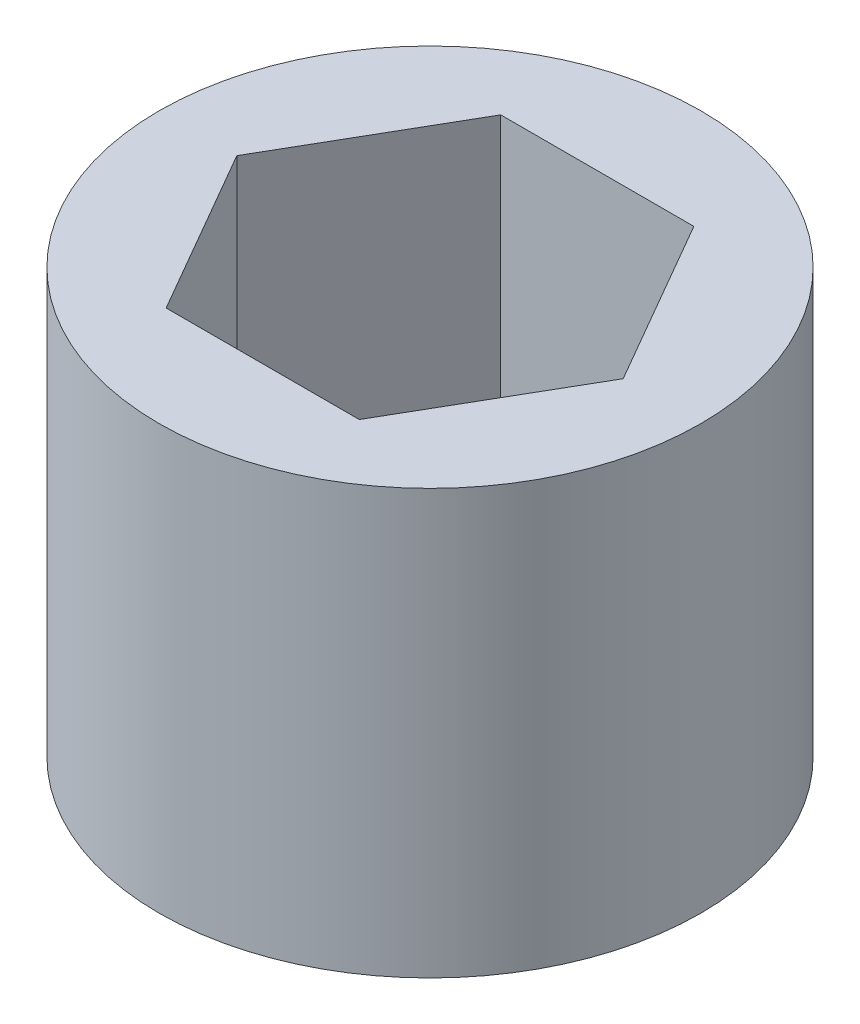
ISO-10303-21;
HEADER;
FILE_DESCRIPTION(('STEP AP214'),'2;1');
FILE_NAME('part.step','',(''),(''),'','','');
FILE_SCHEMA(('AUTOMOTIVE_DESIGN { 1 0 10303 214 1 1 1 1 }'));
ENDSEC;
DATA;
#1=APPLICATION_CONTEXT('core data for automotive mechanical design processes');
#2=APPLICATION_PROTOCOL_DEFINITION('international standard','automotive_design',2000,#1);
#3=PRODUCT_CONTEXT('',#1,'mechanical');
#4=PRODUCT('Part','Part','',(#3));
#5=PRODUCT_RELATED_PRODUCT_CATEGORY('part','',(#4));
#6=PRODUCT_DEFINITION_FORMATION('','',#4);
#7=PRODUCT_DEFINITION_CONTEXT('part definition',#1,'design');
#8=PRODUCT_DEFINITION('design','',#6,#7);
#9=PRODUCT_DEFINITION_SHAPE('','',#8);
#10=(LENGTH_UNIT() NAMED_UNIT(*) SI_UNIT(.MILLI.,.METRE.));
#11=(NAMED_UNIT(*) PLANE_ANGLE_UNIT() SI_UNIT($,.RADIAN.));
#12=(NAMED_UNIT(*) SI_UNIT($,.STERADIAN.) SOLID_ANGLE_UNIT());
#13=UNCERTAINTY_MEASURE_WITH_UNIT(LENGTH_MEASURE(1.E-05),#10,'distance_accuracy_value','');
#14=(GEOMETRIC_REPRESENTATION_CONTEXT(3) GLOBAL_UNCERTAINTY_ASSIGNED_CONTEXT((#13)) GLOBAL_UNIT_ASSIGNED_CONTEXT((#10,
#11,#12)) REPRESENTATION_CONTEXT('',''));
#15=CARTESIAN_POINT('',(0.,0.,0.));
#16=DIRECTION('',(0.,0.,1.));
#17=DIRECTION('',(1.,0.,0.));
#18=AXIS2_PLACEMENT_3D('',#15,#16,#17);
#19=CARTESIAN_POINT('',(-3.075,9.,1.7753520777581));
#20=DIRECTION('',(0.866025403784439,0.,-0.5));
#21=DIRECTION('',(-0.5,0.,-0.866025403784439));
#22=AXIS2_PLACEMENT_3D('',#19,#20,#21);
#23=PLANE('',#22);
#24=DIRECTION('',(0.5,0.,0.866025403784439));
#25=VECTOR('',#24,1.);
#26=CARTESIAN_POINT('',(-3.075,0.,1.7753520777581));
#27=LINE('',#26,#25);
#28=CARTESIAN_POINT('',(-4.1,0.,0.));
#29=VERTEX_POINT('',#28);
#30=CARTESIAN_POINT('',(-2.05,0.,3.5507041555162));
#31=VERTEX_POINT('',#30);
#32=EDGE_CURVE('E118',#29,#31,#27,.T.);
#33=ORIENTED_EDGE('',*,*,#32,.F.);
#34=DIRECTION('',(0.,-1.,0.));
#35=VECTOR('',#34,1.);
#36=CARTESIAN_POINT('',(-4.1,9.,0.));
#37=LINE('',#36,#35);
#38=CARTESIAN_POINT('',(-4.1,9.,0.));
#39=VERTEX_POINT('',#38);
#40=EDGE_CURVE('E11',#39,#29,#37,.T.);
#41=ORIENTED_EDGE('',*,*,#40,.F.);
#42=DIRECTION('',(0.5,0.,0.866025403784439));
#43=VECTOR('',#42,1.);
#44=CARTESIAN_POINT('',(-3.075,9.,1.7753520777581));
#45=LINE('',#44,#43);
#46=CARTESIAN_POINT('',(-2.05,9.,3.5507041555162));
#47=VERTEX_POINT('',#46);
#48=EDGE_CURVE('E135',#39,#47,#45,.T.);
#49=ORIENTED_EDGE('',*,*,#48,.T.);
#50=DIRECTION('',(0.,-1.,0.));
#51=VECTOR('',#50,1.);
#52=CARTESIAN_POINT('',(-2.05,9.,3.5507041555162));
#53=LINE('',#52,#51);
#54=EDGE_CURVE('E49',#47,#31,#53,.T.);
#55=ORIENTED_EDGE('',*,*,#54,.T.);
#56=EDGE_LOOP('',(#33,#41,#49,#55));
#57=FACE_BOUND('',#56,.T.);
#58=ADVANCED_FACE('F33',(#57),#23,.T.);
#59=CARTESIAN_POINT('',(-3.075,9.,-1.7753520777581));
#60=DIRECTION('',(0.866025403784439,0.,0.5));
#61=DIRECTION('',(0.5,0.,-0.866025403784439));
#62=AXIS2_PLACEMENT_3D('',#59,#60,#61);
#63=PLANE('',#62);
#64=DIRECTION('',(-0.5,0.,0.866025403784439));
#65=VECTOR('',#64,1.);
#66=CARTESIAN_POINT('',(-3.075,0.,-1.7753520777581));
#67=LINE('',#66,#65);
#68=CARTESIAN_POINT('',(-2.05,0.,-3.5507041555162));
#69=VERTEX_POINT('',#68);
#70=EDGE_CURVE('E120',#69,#29,#67,.T.);
#71=ORIENTED_EDGE('',*,*,#70,.F.);
#72=DIRECTION('',(0.,-1.,0.));
#73=VECTOR('',#72,1.);
#74=CARTESIAN_POINT('',(-2.05,9.,-3.5507041555162));
#75=LINE('',#74,#73);
#76=CARTESIAN_POINT('',(-2.05,9.,-3.5507041555162));
#77=VERTEX_POINT('',#76);
#78=EDGE_CURVE('E41',#77,#69,#75,.T.);
#79=ORIENTED_EDGE('',*,*,#78,.F.);
#80=DIRECTION('',(-0.5,0.,0.866025403784439));
#81=VECTOR('',#80,1.);
#82=CARTESIAN_POINT('',(-3.075,9.,-1.7753520777581));
#83=LINE('',#82,#81);
#84=EDGE_CURVE('E260',#77,#39,#83,.T.);
#85=ORIENTED_EDGE('',*,*,#84,.T.);
#86=ORIENTED_EDGE('',*,*,#40,.T.);
#87=EDGE_LOOP('',(#71,#79,#85,#86));
#88=FACE_BOUND('',#87,.T.);
#89=ADVANCED_FACE('F144',(#88),#63,.T.);
#90=CARTESIAN_POINT('',(0.,9.,-3.5507041555162));
#91=DIRECTION('',(0.,0.,1.));
#92=DIRECTION('',(1.,0.,0.));
#93=AXIS2_PLACEMENT_3D('',#90,#91,#92);
#94=PLANE('',#93);
#95=DIRECTION('',(-1.,0.,0.));
#96=VECTOR('',#95,1.);
#97=CARTESIAN_POINT('',(0.,0.,-3.5507041555162));
#98=LINE('',#97,#96);
#99=CARTESIAN_POINT('',(2.05,0.,-3.5507041555162));
#100=VERTEX_POINT('',#99);
#101=EDGE_CURVE('E123',#100,#69,#98,.T.);
#102=ORIENTED_EDGE('',*,*,#101,.F.);
#103=DIRECTION('',(0.,-1.,0.));
#104=VECTOR('',#103,1.);
#105=CARTESIAN_POINT('',(2.05,9.,-3.5507041555162));
#106=LINE('',#105,#104);
#107=CARTESIAN_POINT('',(2.05,9.,-3.5507041555162));
#108=VERTEX_POINT('',#107);
#109=EDGE_CURVE('E96',#108,#100,#106,.T.);
#110=ORIENTED_EDGE('',*,*,#109,.F.);
#111=DIRECTION('',(-1.,0.,0.));
#112=VECTOR('',#111,1.);
#113=CARTESIAN_POINT('',(0.,9.,-3.5507041555162));
#114=LINE('',#113,#112);
#115=EDGE_CURVE('E107',#108,#77,#114,.T.);
#116=ORIENTED_EDGE('',*,*,#115,.T.);
#117=ORIENTED_EDGE('',*,*,#78,.T.);
#118=EDGE_LOOP('',(#102,#110,#116,#117));
#119=FACE_BOUND('',#118,.T.);
#120=ADVANCED_FACE('F141',(#119),#94,.T.);
#121=CARTESIAN_POINT('',(3.075,9.,-1.7753520777581));
#122=DIRECTION('',(-0.866025403784439,0.,0.5));
#123=DIRECTION('',(0.5,0.,0.866025403784439));
#124=AXIS2_PLACEMENT_3D('',#121,#122,#123);
#125=PLANE('',#124);
#126=DIRECTION('',(-0.5,0.,-0.866025403784439));
#127=VECTOR('',#126,1.);
#128=CARTESIAN_POINT('',(3.075,0.,-1.7753520777581));
#129=LINE('',#128,#127);
#130=CARTESIAN_POINT('',(4.1,0.,0.));
#131=VERTEX_POINT('',#130);
#132=EDGE_CURVE('E92',#131,#100,#129,.T.);
#133=ORIENTED_EDGE('',*,*,#132,.F.);
#134=DIRECTION('',(0.,-1.,0.));
#135=VECTOR('',#134,1.);
#136=CARTESIAN_POINT('',(4.1,9.,0.));
#137=LINE('',#136,#135);
#138=CARTESIAN_POINT('',(4.1,9.,0.));
#139=VERTEX_POINT('',#138);
#140=EDGE_CURVE('E87',#139,#131,#137,.T.);
#141=ORIENTED_EDGE('',*,*,#140,.F.);
#142=DIRECTION('',(-0.5,0.,-0.866025403784439));
#143=VECTOR('',#142,1.);
#144=CARTESIAN_POINT('',(3.075,9.,-1.7753520777581));
#145=LINE('',#144,#143);
#146=EDGE_CURVE('E90',#139,#108,#145,.T.);
#147=ORIENTED_EDGE('',*,*,#146,.T.);
#148=ORIENTED_EDGE('',*,*,#109,.T.);
#149=EDGE_LOOP('',(#133,#141,#147,#148));
#150=FACE_BOUND('',#149,.T.);
#151=ADVANCED_FACE('F89',(#150),#125,.T.);
#152=CARTESIAN_POINT('',(3.075,9.,1.7753520777581));
#153=DIRECTION('',(-0.866025403784439,0.,-0.5));
#154=DIRECTION('',(-0.5,0.,0.866025403784439));
#155=AXIS2_PLACEMENT_3D('',#152,#153,#154);
#156=PLANE('',#155);
#157=DIRECTION('',(0.5,0.,-0.866025403784439));
#158=VECTOR('',#157,1.);
#159=CARTESIAN_POINT('',(3.075,0.,1.7753520777581));
#160=LINE('',#159,#158);
#161=CARTESIAN_POINT('',(2.05,0.,3.5507041555162));
#162=VERTEX_POINT('',#161);
#163=EDGE_CURVE('E127',#162,#131,#160,.T.);
#164=ORIENTED_EDGE('',*,*,#163,.F.);
#165=DIRECTION('',(0.,-1.,0.));
#166=VECTOR('',#165,1.);
#167=CARTESIAN_POINT('',(2.05,9.,3.5507041555162));
#168=LINE('',#167,#166);
#169=CARTESIAN_POINT('',(2.05,9.,3.5507041555162));
#170=VERTEX_POINT('',#169);
#171=EDGE_CURVE('E68',#170,#162,#168,.T.);
#172=ORIENTED_EDGE('',*,*,#171,.F.);
#173=DIRECTION('',(0.5,0.,-0.866025403784439));
#174=VECTOR('',#173,1.);
#175=CARTESIAN_POINT('',(3.075,9.,1.7753520777581));
#176=LINE('',#175,#174);
#177=EDGE_CURVE('E104',#170,#139,#176,.T.);
#178=ORIENTED_EDGE('',*,*,#177,.T.);
#179=ORIENTED_EDGE('',*,*,#140,.T.);
#180=EDGE_LOOP('',(#164,#172,#178,#179));
#181=FACE_BOUND('',#180,.T.);
#182=ADVANCED_FACE('F109',(#181),#156,.T.);
#183=CARTESIAN_POINT('',(0.,9.,3.5507041555162));
#184=DIRECTION('',(0.,0.,-1.));
#185=DIRECTION('',(-1.,0.,0.));
#186=AXIS2_PLACEMENT_3D('',#183,#184,#185);
#187=PLANE('',#186);
#188=DIRECTION('',(1.,0.,0.));
#189=VECTOR('',#188,1.);
#190=CARTESIAN_POINT('',(0.,0.,3.5507041555162));
#191=LINE('',#190,#189);
#192=EDGE_CURVE('E129',#31,#162,#191,.T.);
#193=ORIENTED_EDGE('',*,*,#192,.F.);
#194=ORIENTED_EDGE('',*,*,#54,.F.);
#195=DIRECTION('',(1.,0.,0.));
#196=VECTOR('',#195,1.);
#197=CARTESIAN_POINT('',(0.,9.,3.5507041555162));
#198=LINE('',#197,#196);
#199=EDGE_CURVE('E110',#47,#170,#198,.T.);
#200=ORIENTED_EDGE('',*,*,#199,.T.);
#201=ORIENTED_EDGE('',*,*,#171,.T.);
#202=EDGE_LOOP('',(#193,#194,#200,#201));
#203=FACE_BOUND('',#202,.T.);
#204=ADVANCED_FACE('F148',(#203),#187,.T.);
#205=CARTESIAN_POINT('',(0.,9.,0.));
#206=DIRECTION('',(0.,-1.,0.));
#207=DIRECTION('',(0.,0.,-1.));
#208=AXIS2_PLACEMENT_3D('',#205,#206,#207);
#209=CYLINDRICAL_SURFACE('',#208,5.75);
#210=CARTESIAN_POINT('',(0.,9.,0.));
#211=DIRECTION('',(0.,1.,0.));
#212=DIRECTION('',(0.,0.,1.));
#213=AXIS2_PLACEMENT_3D('',#210,#211,#212);
#214=CIRCLE('',#213,5.75);
#215=CARTESIAN_POINT('',(0.,9.,5.75));
#216=VERTEX_POINT('',#215);
#217=EDGE_CURVE('E112',#216,#216,#214,.T.);
#218=ORIENTED_EDGE('',*,*,#217,.F.);
#219=EDGE_LOOP('',(#218));
#220=FACE_BOUND('',#219,.T.);
#221=CARTESIAN_POINT('',(0.,0.,0.));
#222=DIRECTION('',(0.,1.,0.));
#223=DIRECTION('',(0.,0.,1.));
#224=AXIS2_PLACEMENT_3D('',#221,#222,#223);
#225=CIRCLE('',#224,5.75);
#226=CARTESIAN_POINT('',(0.,0.,5.75));
#227=VERTEX_POINT('',#226);
#228=EDGE_CURVE('E132',#227,#227,#225,.T.);
#229=ORIENTED_EDGE('',*,*,#228,.T.);
#230=EDGE_LOOP('',(#229));
#231=FACE_BOUND('',#230,.T.);
#232=ADVANCED_FACE('F150',(#220,#231),#209,.T.);
#233=CARTESIAN_POINT('',(0.,9.,0.));
#234=DIRECTION('',(0.,1.,0.));
#235=DIRECTION('',(0.,0.,1.));
#236=AXIS2_PLACEMENT_3D('',#233,#234,#235);
#237=PLANE('',#236);
#238=ORIENTED_EDGE('',*,*,#48,.F.);
#239=ORIENTED_EDGE('',*,*,#84,.F.);
#240=ORIENTED_EDGE('',*,*,#115,.F.);
#241=ORIENTED_EDGE('',*,*,#146,.F.);
#242=ORIENTED_EDGE('',*,*,#177,.F.);
#243=ORIENTED_EDGE('',*,*,#199,.F.);
#244=EDGE_LOOP('',(#238,#239,#240,#241,#242,#243));
#245=FACE_BOUND('',#244,.T.);
#246=ORIENTED_EDGE('',*,*,#217,.T.);
#247=EDGE_LOOP('',(#246));
#248=FACE_BOUND('',#247,.T.);
#249=ADVANCED_FACE('F101',(#245,#248),#237,.T.);
#250=CARTESIAN_POINT('',(0.,0.,0.));
#251=DIRECTION('',(0.,1.,0.));
#252=DIRECTION('',(0.,0.,1.));
#253=AXIS2_PLACEMENT_3D('',#250,#251,#252);
#254=PLANE('',#253);
#255=ORIENTED_EDGE('',*,*,#32,.T.);
#256=ORIENTED_EDGE('',*,*,#192,.T.);
#257=ORIENTED_EDGE('',*,*,#163,.T.);
#258=ORIENTED_EDGE('',*,*,#132,.T.);
#259=ORIENTED_EDGE('',*,*,#101,.T.);
#260=ORIENTED_EDGE('',*,*,#70,.T.);
#261=EDGE_LOOP('',(#255,#256,#257,#258,#259,#260));
#262=FACE_BOUND('',#261,.T.);
#263=ORIENTED_EDGE('',*,*,#228,.F.);
#264=EDGE_LOOP('',(#263));
#265=FACE_BOUND('',#264,.T.);
#266=ADVANCED_FACE('F146',(#262,#265),#254,.F.);
#267=CLOSED_SHELL('',(#58,#89,#120,#151,#182,#204,#232,#249,#266));
#268=MANIFOLD_SOLID_BREP('B2',#267);
#269=ADVANCED_BREP_SHAPE_REPRESENTATION('',(#18,#268),#14);
#270=SHAPE_DEFINITION_REPRESENTATION(#9,#269);
ENDSEC;
END-ISO-10303-21;
